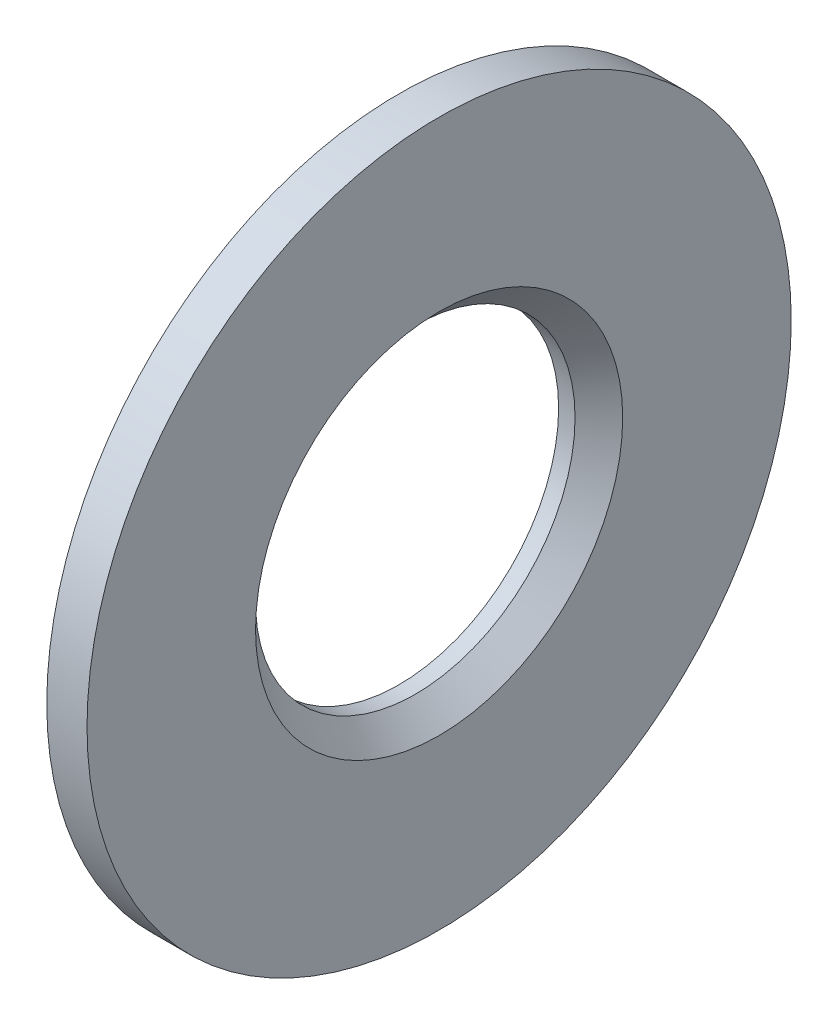
ISO-10303-21;
HEADER;
FILE_DESCRIPTION(('STEP AP214'),'2;1');
FILE_NAME('part.step','',(''),(''),'','','');
FILE_SCHEMA(('AUTOMOTIVE_DESIGN { 1 0 10303 214 1 1 1 1 }'));
ENDSEC;
DATA;
#1=APPLICATION_CONTEXT('core data for automotive mechanical design processes');
#2=APPLICATION_PROTOCOL_DEFINITION('international standard','automotive_design',2000,#1);
#3=PRODUCT_CONTEXT('',#1,'mechanical');
#4=PRODUCT('Part','Part','',(#3));
#5=PRODUCT_RELATED_PRODUCT_CATEGORY('part','',(#4));
#6=PRODUCT_DEFINITION_FORMATION('','',#4);
#7=PRODUCT_DEFINITION_CONTEXT('part definition',#1,'design');
#8=PRODUCT_DEFINITION('design','',#6,#7);
#9=PRODUCT_DEFINITION_SHAPE('','',#8);
#10=(LENGTH_UNIT() NAMED_UNIT(*) SI_UNIT(.MILLI.,.METRE.));
#11=(NAMED_UNIT(*) PLANE_ANGLE_UNIT() SI_UNIT($,.RADIAN.));
#12=(NAMED_UNIT(*) SI_UNIT($,.STERADIAN.) SOLID_ANGLE_UNIT());
#13=UNCERTAINTY_MEASURE_WITH_UNIT(LENGTH_MEASURE(1.E-05),#10,'distance_accuracy_value','');
#14=(GEOMETRIC_REPRESENTATION_CONTEXT(3) GLOBAL_UNCERTAINTY_ASSIGNED_CONTEXT((#13)) GLOBAL_UNIT_ASSIGNED_CONTEXT((#10,
#11,#12)) REPRESENTATION_CONTEXT('',''));
#15=CARTESIAN_POINT('',(0.,0.,0.));
#16=DIRECTION('',(0.,0.,1.));
#17=DIRECTION('',(1.,0.,0.));
#18=AXIS2_PLACEMENT_3D('',#15,#16,#17);
#19=CARTESIAN_POINT('',(1.27,0.,0.));
#20=DIRECTION('',(-1.,0.,0.));
#21=DIRECTION('',(0.,0.,1.));
#22=AXIS2_PLACEMENT_3D('',#19,#20,#21);
#23=CYLINDRICAL_SURFACE('',#22,11.1125);
#24=CARTESIAN_POINT('',(1.27,0.,0.));
#25=DIRECTION('',(1.,0.,0.));
#26=DIRECTION('',(0.,0.,-1.));
#27=AXIS2_PLACEMENT_3D('',#24,#25,#26);
#28=CIRCLE('',#27,11.1125);
#29=CARTESIAN_POINT('',(1.27,0.,-11.1125));
#30=VERTEX_POINT('',#29);
#31=EDGE_CURVE('E10',#30,#30,#28,.T.);
#32=ORIENTED_EDGE('',*,*,#31,.F.);
#33=EDGE_LOOP('',(#32));
#34=FACE_BOUND('',#33,.T.);
#35=CARTESIAN_POINT('',(0.,0.,0.));
#36=DIRECTION('',(1.,0.,0.));
#37=DIRECTION('',(0.,0.,-1.));
#38=AXIS2_PLACEMENT_3D('',#35,#36,#37);
#39=CIRCLE('',#38,11.1125);
#40=CARTESIAN_POINT('',(0.,0.,-11.1125));
#41=VERTEX_POINT('',#40);
#42=EDGE_CURVE('E34',#41,#41,#39,.T.);
#43=ORIENTED_EDGE('',*,*,#42,.T.);
#44=EDGE_LOOP('',(#43));
#45=FACE_BOUND('',#44,.T.);
#46=ADVANCED_FACE('F31',(#34,#45),#23,.T.);
#47=CARTESIAN_POINT('',(1.27,0.,0.));
#48=DIRECTION('',(1.,0.,0.));
#49=DIRECTION('',(0.,0.,-1.));
#50=AXIS2_PLACEMENT_3D('',#47,#48,#49);
#51=PLANE('',#50);
#52=CARTESIAN_POINT('',(1.27,0.,0.));
#53=DIRECTION('',(1.,0.,0.));
#54=DIRECTION('',(0.,0.,-1.));
#55=AXIS2_PLACEMENT_3D('',#52,#53,#54);
#56=CIRCLE('',#55,5.79374);
#57=CARTESIAN_POINT('',(1.27,0.,-5.79374));
#58=VERTEX_POINT('',#57);
#59=EDGE_CURVE('E48',#58,#58,#56,.T.);
#60=ORIENTED_EDGE('',*,*,#59,.F.);
#61=EDGE_LOOP('',(#60));
#62=FACE_BOUND('',#61,.T.);
#63=ORIENTED_EDGE('',*,*,#31,.T.);
#64=EDGE_LOOP('',(#63));
#65=FACE_BOUND('',#64,.T.);
#66=ADVANCED_FACE('F54',(#62,#65),#51,.T.);
#67=CARTESIAN_POINT('',(0.,0.,0.));
#68=DIRECTION('',(1.,0.,0.));
#69=DIRECTION('',(0.,0.,-1.));
#70=AXIS2_PLACEMENT_3D('',#67,#68,#69);
#71=PLANE('',#70);
#72=CARTESIAN_POINT('',(0.,0.,0.));
#73=DIRECTION('',(1.,0.,0.));
#74=DIRECTION('',(0.,0.,-1.));
#75=AXIS2_PLACEMENT_3D('',#72,#73,#74);
#76=CIRCLE('',#75,5.0419);
#77=CARTESIAN_POINT('',(0.,0.,-5.0419));
#78=VERTEX_POINT('',#77);
#79=EDGE_CURVE('E41',#78,#78,#76,.T.);
#80=ORIENTED_EDGE('',*,*,#79,.T.);
#81=EDGE_LOOP('',(#80));
#82=FACE_BOUND('',#81,.T.);
#83=ORIENTED_EDGE('',*,*,#42,.F.);
#84=EDGE_LOOP('',(#83));
#85=FACE_BOUND('',#84,.T.);
#86=ADVANCED_FACE('F56',(#82,#85),#71,.F.);
#87=CARTESIAN_POINT('',(1.27,0.,0.));
#88=DIRECTION('',(1.,0.,0.));
#89=DIRECTION('',(0.,0.,-1.));
#90=AXIS2_PLACEMENT_3D('',#87,#88,#89);
#91=CYLINDRICAL_SURFACE('',#90,5.0419);
#92=ORIENTED_EDGE('',*,*,#79,.F.);
#93=EDGE_LOOP('',(#92));
#94=FACE_BOUND('',#93,.T.);
#95=CARTESIAN_POINT('',(0.518160000000001,0.,0.));
#96=DIRECTION('',(1.,0.,0.));
#97=DIRECTION('',(0.,0.,-1.));
#98=AXIS2_PLACEMENT_3D('',#95,#96,#97);
#99=CIRCLE('',#98,5.0419);
#100=CARTESIAN_POINT('',(0.518160000000001,0.,-5.0419));
#101=VERTEX_POINT('',#100);
#102=EDGE_CURVE('E45',#101,#101,#99,.T.);
#103=ORIENTED_EDGE('',*,*,#102,.T.);
#104=EDGE_LOOP('',(#103));
#105=FACE_BOUND('',#104,.T.);
#106=ADVANCED_FACE('F62',(#94,#105),#91,.F.);
#107=CARTESIAN_POINT('',(1.27,0.,0.));
#108=DIRECTION('',(1.,0.,0.));
#109=DIRECTION('',(0.,0.,-1.));
#110=AXIS2_PLACEMENT_3D('',#107,#108,#109);
#111=CONICAL_SURFACE('',#110,5.79374,0.785398163397448);
#112=ORIENTED_EDGE('',*,*,#102,.F.);
#113=EDGE_LOOP('',(#112));
#114=FACE_BOUND('',#113,.T.);
#115=ORIENTED_EDGE('',*,*,#59,.T.);
#116=EDGE_LOOP('',(#115));
#117=FACE_BOUND('',#116,.T.);
#118=ADVANCED_FACE('F52',(#114,#117),#111,.F.);
#119=CLOSED_SHELL('',(#46,#66,#86,#106,#118));
#120=MANIFOLD_SOLID_BREP('B2',#119);
#121=ADVANCED_BREP_SHAPE_REPRESENTATION('',(#18,#120),#14);
#122=SHAPE_DEFINITION_REPRESENTATION(#9,#121);
ENDSEC;
END-ISO-10303-21;
